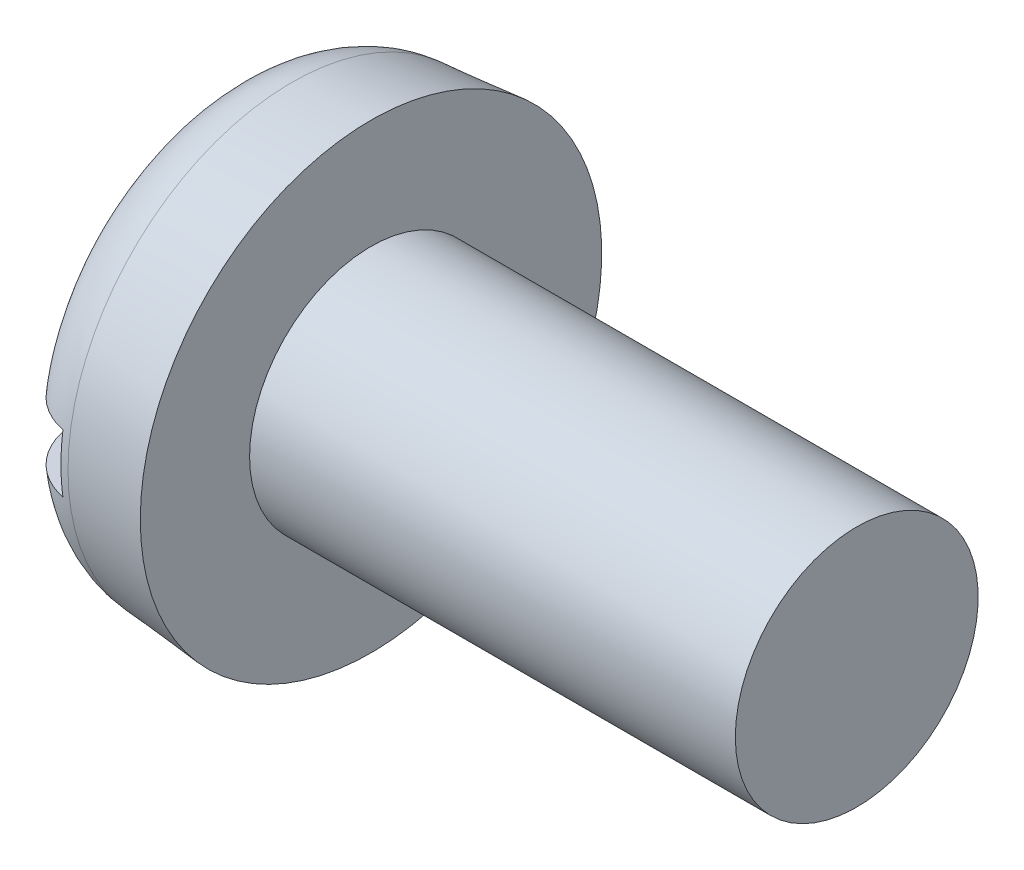
ISO-10303-21;
HEADER;
FILE_DESCRIPTION(('STEP AP214'),'2;1');
FILE_NAME('part.step','',(''),(''),'','','');
FILE_SCHEMA(('AUTOMOTIVE_DESIGN { 1 0 10303 214 1 1 1 1 }'));
ENDSEC;
DATA;
#1=APPLICATION_CONTEXT('core data for automotive mechanical design processes');
#2=APPLICATION_PROTOCOL_DEFINITION('international standard','automotive_design',2000,#1);
#3=PRODUCT_CONTEXT('',#1,'mechanical');
#4=PRODUCT('Part','Part','',(#3));
#5=PRODUCT_RELATED_PRODUCT_CATEGORY('part','',(#4));
#6=PRODUCT_DEFINITION_FORMATION('','',#4);
#7=PRODUCT_DEFINITION_CONTEXT('part definition',#1,'design');
#8=PRODUCT_DEFINITION('design','',#6,#7);
#9=PRODUCT_DEFINITION_SHAPE('','',#8);
#10=(LENGTH_UNIT() NAMED_UNIT(*) SI_UNIT(.MILLI.,.METRE.));
#11=(NAMED_UNIT(*) PLANE_ANGLE_UNIT() SI_UNIT($,.RADIAN.));
#12=(NAMED_UNIT(*) SI_UNIT($,.STERADIAN.) SOLID_ANGLE_UNIT());
#13=UNCERTAINTY_MEASURE_WITH_UNIT(LENGTH_MEASURE(1.E-05),#10,'distance_accuracy_value','');
#14=(GEOMETRIC_REPRESENTATION_CONTEXT(3) GLOBAL_UNCERTAINTY_ASSIGNED_CONTEXT((#13)) GLOBAL_UNIT_ASSIGNED_CONTEXT((#10,
#11,#12)) REPRESENTATION_CONTEXT('',''));
#15=CARTESIAN_POINT('',(0.,0.,0.));
#16=DIRECTION('',(0.,0.,1.));
#17=DIRECTION('',(1.,0.,0.));
#18=AXIS2_PLACEMENT_3D('',#15,#16,#17);
#19=CARTESIAN_POINT('',(0.,0.,0.));
#20=DIRECTION('',(-1.,0.,0.));
#21=DIRECTION('',(0.,0.,1.));
#22=AXIS2_PLACEMENT_3D('',#19,#20,#21);
#23=PLANE('',#22);
#24=DIRECTION('',(0.,0.,-1.));
#25=VECTOR('',#24,1.);
#26=CARTESIAN_POINT('',(0.,0.599999999999999,4.75));
#27=LINE('',#26,#25);
#28=CARTESIAN_POINT('',(0.,0.599999999999999,3.05466870706162));
#29=VERTEX_POINT('',#28);
#30=CARTESIAN_POINT('',(0.,0.599999999999999,-3.05466870706162));
#31=VERTEX_POINT('',#30);
#32=EDGE_CURVE('E85',#29,#31,#27,.T.);
#33=ORIENTED_EDGE('',*,*,#32,.F.);
#34=CARTESIAN_POINT('',(0.,0.,0.));
#35=DIRECTION('',(-1.,0.,0.));
#36=DIRECTION('',(0.,0.,1.));
#37=AXIS2_PLACEMENT_3D('',#34,#35,#36);
#38=CIRCLE('',#37,3.11303724839609);
#39=EDGE_CURVE('E91',#29,#31,#38,.T.);
#40=ORIENTED_EDGE('',*,*,#39,.T.);
#41=EDGE_LOOP('',(#33,#40));
#42=FACE_BOUND('',#41,.T.);
#43=ADVANCED_FACE('F32',(#42),#23,.T.);
#44=CARTESIAN_POINT('',(-25.4,0.,0.));
#45=DIRECTION('',(-1.,0.,0.));
#46=DIRECTION('',(0.,0.,1.));
#47=AXIS2_PLACEMENT_3D('',#44,#45,#46);
#48=CYLINDRICAL_SURFACE('',#47,2.5);
#49=CARTESIAN_POINT('',(13.,0.,0.));
#50=DIRECTION('',(-1.,0.,0.));
#51=DIRECTION('',(0.,0.,1.));
#52=AXIS2_PLACEMENT_3D('',#49,#50,#51);
#53=CIRCLE('',#52,2.5);
#54=CARTESIAN_POINT('',(13.,0.,2.5));
#55=VERTEX_POINT('',#54);
#56=EDGE_CURVE('E92',#55,#55,#53,.T.);
#57=ORIENTED_EDGE('',*,*,#56,.T.);
#58=EDGE_LOOP('',(#57));
#59=FACE_BOUND('',#58,.T.);
#60=CARTESIAN_POINT('',(3.,0.,0.));
#61=DIRECTION('',(-1.,0.,0.));
#62=DIRECTION('',(0.,0.,1.));
#63=AXIS2_PLACEMENT_3D('',#60,#61,#62);
#64=CIRCLE('',#63,2.5);
#65=CARTESIAN_POINT('',(3.,0.,2.5));
#66=VERTEX_POINT('',#65);
#67=EDGE_CURVE('E149',#66,#66,#64,.T.);
#68=ORIENTED_EDGE('',*,*,#67,.F.);
#69=EDGE_LOOP('',(#68));
#70=FACE_BOUND('',#69,.T.);
#71=ADVANCED_FACE('F137',(#59,#70),#48,.T.);
#72=CARTESIAN_POINT('',(13.,2.5,0.));
#73=DIRECTION('',(1.,0.,0.));
#74=DIRECTION('',(0.,0.,-1.));
#75=AXIS2_PLACEMENT_3D('',#72,#73,#74);
#76=PLANE('',#75);
#77=ORIENTED_EDGE('',*,*,#56,.F.);
#78=EDGE_LOOP('',(#77));
#79=FACE_BOUND('',#78,.T.);
#80=ADVANCED_FACE('F135',(#79),#76,.T.);
#81=DIRECTION('',(0.,0.,1.));
#82=VECTOR('',#81,1.);
#83=CARTESIAN_POINT('',(0.,-0.599999999999999,-4.75));
#84=LINE('',#83,#82);
#85=CARTESIAN_POINT('',(0.,-0.599999999999999,-3.05466870706162));
#86=VERTEX_POINT('',#85);
#87=CARTESIAN_POINT('',(0.,-0.6,3.05466870706162));
#88=VERTEX_POINT('',#87);
#89=EDGE_CURVE('E76',#86,#88,#84,.T.);
#90=ORIENTED_EDGE('',*,*,#89,.F.);
#91=EDGE_CURVE('E83',#86,#88,#38,.T.);
#92=ORIENTED_EDGE('',*,*,#91,.T.);
#93=EDGE_LOOP('',(#90,#92));
#94=FACE_BOUND('',#93,.T.);
#95=ADVANCED_FACE('F82',(#94),#23,.T.);
#96=CARTESIAN_POINT('',(0.,0.,0.));
#97=DIRECTION('',(1.,0.,0.));
#98=DIRECTION('',(0.,0.,-1.));
#99=AXIS2_PLACEMENT_3D('',#96,#97,#98);
#100=CONICAL_SURFACE('',#99,4.48753400942223,0.0872664625997167);
#101=CARTESIAN_POINT('',(1.36926638587852,0.,0.));
#102=DIRECTION('',(-1.,0.,0.));
#103=DIRECTION('',(0.,0.,1.));
#104=AXIS2_PLACEMENT_3D('',#101,#102,#103);
#105=CIRCLE('',#104,4.60732929553371);
#106=CARTESIAN_POINT('',(1.36926638587852,0.,4.60732929553371));
#107=VERTEX_POINT('',#106);
#108=EDGE_CURVE('E95',#107,#107,#105,.F.);
#109=ORIENTED_EDGE('',*,*,#108,.T.);
#110=EDGE_LOOP('',(#109));
#111=FACE_BOUND('',#110,.T.);
#112=CARTESIAN_POINT('',(3.,0.,0.));
#113=DIRECTION('',(-1.,0.,0.));
#114=DIRECTION('',(0.,0.,1.));
#115=AXIS2_PLACEMENT_3D('',#112,#113,#114);
#116=CIRCLE('',#115,4.75);
#117=CARTESIAN_POINT('',(3.,0.,4.75));
#118=VERTEX_POINT('',#117);
#119=EDGE_CURVE('E97',#118,#118,#116,.T.);
#120=ORIENTED_EDGE('',*,*,#119,.T.);
#121=EDGE_LOOP('',(#120));
#122=FACE_BOUND('',#121,.T.);
#123=ADVANCED_FACE('F128',(#111,#122),#100,.T.);
#124=CARTESIAN_POINT('',(3.,2.5,0.));
#125=DIRECTION('',(-1.,0.,0.));
#126=DIRECTION('',(0.,0.,1.));
#127=AXIS2_PLACEMENT_3D('',#124,#125,#126);
#128=PLANE('',#127);
#129=ORIENTED_EDGE('',*,*,#119,.F.);
#130=EDGE_LOOP('',(#129));
#131=FACE_BOUND('',#130,.T.);
#132=ORIENTED_EDGE('',*,*,#67,.T.);
#133=EDGE_LOOP('',(#132));
#134=FACE_BOUND('',#133,.T.);
#135=ADVANCED_FACE('F124',(#131,#134),#128,.F.);
#136=CARTESIAN_POINT('',(1.5,0.,0.));
#137=DIRECTION('',(-1.,0.,0.));
#138=DIRECTION('',(0.,0.,1.));
#139=AXIS2_PLACEMENT_3D('',#136,#137,#138);
#140=TOROIDAL_SURFACE('',#139,3.11303724839609,1.5);
#141=CARTESIAN_POINT('',(0.474243658414118,0.599999999999999,-4.16448807896819));
#142=CARTESIAN_POINT('',(0.535197295081718,0.599999999999999,-4.2222007669978));
#143=CARTESIAN_POINT('',(0.601040982035107,0.599999999999999,-4.27483380157402));
#144=CARTESIAN_POINT('',(0.740675618941929,0.599999999999999,-4.36835495475348));
#145=CARTESIAN_POINT('',(0.814475349823812,0.599999999999999,-4.40922990992468));
#146=CARTESIAN_POINT('',(0.967890518125633,0.599999999999999,-4.47797693612467));
#147=CARTESIAN_POINT('',(1.04750461127898,0.599999999999999,-4.50585200175864));
#148=CARTESIAN_POINT('',(1.21027286001061,0.599999999999999,-4.54777716021195));
#149=CARTESIAN_POINT('',(1.29342617347519,0.599999999999999,-4.56183052276117));
#150=CARTESIAN_POINT('',(1.46061786799049,0.599999999999999,-4.57568541247955));
#151=CARTESIAN_POINT('',(1.54465212521589,0.599999999999999,-4.57553672087045));
#152=CARTESIAN_POINT('',(1.71150157995688,0.599999999999999,-4.56111544224188));
#153=CARTESIAN_POINT('',(1.79431675124403,0.599999999999999,-4.546842551792));
#154=CARTESIAN_POINT('',(1.95628107406591,0.599999999999999,-4.50461633201918));
#155=CARTESIAN_POINT('',(2.03543426015628,0.599999999999999,-4.47667847075145));
#156=CARTESIAN_POINT('',(2.18794473500218,0.599999999999999,-4.40794662558744));
#157=CARTESIAN_POINT('',(2.26130200278936,0.599999999999999,-4.36715259518307));
#158=CARTESIAN_POINT('',(2.40037319828889,0.599999999999999,-4.27376142336048));
#159=CARTESIAN_POINT('',(2.46606492244737,0.599999999999999,-4.22113122683346));
#160=CARTESIAN_POINT('',(2.58775416704056,0.599999999999999,-4.10565865600867));
#161=CARTESIAN_POINT('',(2.64375146828425,0.599999999999999,-4.04281605087046));
#162=CARTESIAN_POINT('',(2.7448997840385,0.599999999999999,-3.90824759164118));
#163=CARTESIAN_POINT('',(2.78997229238531,0.599999999999999,-3.83646274539756));
#164=CARTESIAN_POINT('',(2.86758143470365,0.599999999999999,-3.6864129682638));
#165=CARTESIAN_POINT('',(2.90011748599835,0.599999999999999,-3.60814773637982));
#166=CARTESIAN_POINT('',(2.95215516169723,0.599999999999999,-3.44640006360479));
#167=CARTESIAN_POINT('',(2.9715017345089,0.599999999999999,-3.36286776428823));
#168=CARTESIAN_POINT('',(2.99613620168572,0.599999999999999,-3.19375865105955));
#169=CARTESIAN_POINT('',(3.00142305536604,0.599999999999999,-3.10818168627657));
#170=CARTESIAN_POINT('',(2.9978948813525,0.599999999999999,-2.93593785339293));
#171=CARTESIAN_POINT('',(2.98885075685912,0.599999999999999,-2.84927570052428));
#172=CARTESIAN_POINT('',(2.95661294496956,0.599999999999999,-2.67862588478662));
#173=CARTESIAN_POINT('',(2.93341783650053,0.599999999999999,-2.59463849141423));
#174=CARTESIAN_POINT('',(2.87305940877561,0.599999999999999,-2.43009011436867));
#175=CARTESIAN_POINT('',(2.8356478828304,0.599999999999999,-2.3496201371126));
#176=CARTESIAN_POINT('',(2.74798933787028,0.599999999999999,-2.1959917281391));
#177=CARTESIAN_POINT('',(2.69774036841306,0.599999999999999,-2.12283440981409));
#178=CARTESIAN_POINT('',(2.58515210313488,0.599999999999999,-1.98517825774364));
#179=CARTESIAN_POINT('',(2.52268993172068,0.599999999999999,-1.92077976119305));
#180=CARTESIAN_POINT('',(2.3876474493881,0.599999999999999,-1.80360821500934));
#181=CARTESIAN_POINT('',(2.31506700040253,0.599999999999999,-1.75083532403676));
#182=CARTESIAN_POINT('',(2.16324197079703,0.599999999999999,-1.65981326851198));
#183=CARTESIAN_POINT('',(2.08415844928075,0.599999999999999,-1.62129637029772));
#184=CARTESIAN_POINT('',(1.92036681915816,0.599999999999999,-1.55909823822307));
#185=CARTESIAN_POINT('',(1.83566227533763,0.599999999999999,-1.53540769925334));
#186=CARTESIAN_POINT('',(1.66868507009008,0.599999999999999,-1.50512561227213));
#187=CARTESIAN_POINT('',(1.58658829454821,0.599999999999999,-1.4975631393788));
#188=CARTESIAN_POINT('',(1.42235866322455,0.599999999999999,-1.49703912758717));
#189=CARTESIAN_POINT('',(1.34022582120447,0.599999999999999,-1.50407401302566));
#190=CARTESIAN_POINT('',(1.18200056282713,0.599999999999999,-1.53172166919514));
#191=CARTESIAN_POINT('',(1.10580089104436,0.599999999999999,-1.55172937668989));
#192=CARTESIAN_POINT('',(0.957649664563,0.599999999999999,-1.60381093076415));
#193=CARTESIAN_POINT('',(0.885698997531768,0.599999999999999,-1.63588728838267));
#194=CARTESIAN_POINT('',(0.745245700500113,0.599999999999999,-1.71223681434578));
#195=CARTESIAN_POINT('',(0.676958373668154,0.599999999999999,-1.75690511342937));
#196=CARTESIAN_POINT('',(0.548253189657998,0.599999999999999,-1.85641398037802));
#197=CARTESIAN_POINT('',(0.487837367378207,0.599999999999999,-1.91125716975333));
#198=CARTESIAN_POINT('',(0.372604632815819,0.599999999999999,-2.0333995748207));
#199=CARTESIAN_POINT('',(0.318393734552892,0.599999999999999,-2.10127142840843));
#200=CARTESIAN_POINT('',(0.22172170046403,0.599999999999999,-2.24492747086233));
#201=CARTESIAN_POINT('',(0.179262687674716,0.599999999999999,-2.32071308598748));
#202=CARTESIAN_POINT('',(0.106126434693669,0.599999999999999,-2.48060945032927));
#203=CARTESIAN_POINT('',(0.0758504579499817,0.599999999999999,-2.56490423799231));
#204=CARTESIAN_POINT('',(0.0299480528791069,0.599999999999999,-2.737393644571));
#205=CARTESIAN_POINT('',(0.0143211057149615,0.599999999999999,-2.82558812525209));
#206=CARTESIAN_POINT('',(-0.00166405076915353,0.599999999999999,-3.00295249376628));
#207=CARTESIAN_POINT('',(-0.0020913391866633,0.599999999999999,-3.09211612589326));
#208=CARTESIAN_POINT('',(0.012315323636572,0.599999999999999,-3.26923006707988));
#209=CARTESIAN_POINT('',(0.0271518634913197,0.599999999999999,-3.35718016777113));
#210=CARTESIAN_POINT('',(0.0713942440842871,0.599999999999999,-3.52770551832453));
#211=CARTESIAN_POINT('',(0.100543843103939,0.599999999999999,-3.61034739221481));
#212=CARTESIAN_POINT('',(0.172532615577993,0.599999999999999,-3.7693538221972));
#213=CARTESIAN_POINT('',(0.215353537348166,0.599999999999999,-3.84572657785127));
#214=CARTESIAN_POINT('',(0.294810584189995,0.599999999999999,-3.9625299446579));
#215=CARTESIAN_POINT('',(0.327631230412885,0.599999999999999,-4.00560511672895));
#216=CARTESIAN_POINT('',(0.397705420360597,0.599999999999999,-4.08798619296731));
#217=CARTESIAN_POINT('',(0.434958917942831,0.599999999999999,-4.12729213636171));
#218=CARTESIAN_POINT('',(0.474243658414118,0.599999999999999,-4.16448807896819));
#219=B_SPLINE_CURVE_WITH_KNOTS('',3,(#141,#142,#143,#144,#145,#146,#147,#148,#149,#150,#151,
#152,#153,#154,#155,#156,#157,#158,#159,#160,#161,#162,#163,#164,#165,#166,#167,#168,#169,#170,
#171,#172,#173,#174,#175,#176,#177,#178,#179,#180,#181,#182,#183,#184,#185,#186,#187,#188,#189,
#190,#191,#192,#193,#194,#195,#196,#197,#198,#199,#200,#201,#202,#203,#204,#205,#206,#207,#208,
#209,#210,#211,#212,#213,#214,#215,#216,#217,#218),.UNSPECIFIED.,.T.,.F.,(4,2,2,2,2,2,2,2,2,2,2,
2,2,2,2,2,2,2,2,2,2,2,2,2,2,2,2,2,2,2,2,2,2,2,2,2,2,2,4),(0.,0.251627146356527,
0.503534908230532,0.755384612891179,1.00717472440947,1.25808229051165,1.50899524698256,
1.75962483769725,2.01025533509253,2.26159466241291,2.5129396717769,2.76604060118133,
3.01915329294131,3.27519243939531,3.53125053705573,3.79144347935941,4.05166255511108,
4.31665070629994,4.58167914212856,4.84952563339749,5.1173757798769,5.37990411366445,
5.64226751747475,5.88833003654373,6.13433228903482,6.36961414082621,6.60494497315005,
6.84869102964653,7.09249997354317,7.35191672321244,7.61138030726588,7.87880123289685,
8.14621268669888,8.41240865838555,8.67864978206268,8.94028930530327,9.20158098124828,
9.36375686720108,9.52593106517475),.UNSPECIFIED.);
#220=CARTESIAN_POINT('',(1.2,0.599999999999999,-4.54328342507039));
#221=VERTEX_POINT('',#220);
#222=EDGE_CURVE('E11',#31,#221,#219,.T.);
#223=ORIENTED_EDGE('',*,*,#222,.F.);
#224=ORIENTED_EDGE('',*,*,#39,.F.);
#225=CARTESIAN_POINT('',(0.642058610680042,0.599999999999999,1.78444467937446));
#226=CARTESIAN_POINT('',(0.708203036380362,0.599999999999999,1.73578880648515));
#227=CARTESIAN_POINT('',(0.778279368670585,0.599999999999999,1.69241067896619));
#228=CARTESIAN_POINT('',(0.924661322194506,0.599999999999999,1.61775076908607));
#229=CARTESIAN_POINT('',(1.00097010153863,0.599999999999999,1.58647516596051));
#230=CARTESIAN_POINT('',(1.15801751585214,0.599999999999999,1.537335320697));
#231=CARTESIAN_POINT('',(1.23876602400661,0.599999999999999,1.51950238335516));
#232=CARTESIAN_POINT('',(1.40212199318037,0.599999999999999,1.49831173721129));
#233=CARTESIAN_POINT('',(1.48472861131334,0.599999999999999,1.49494759299464));
#234=CARTESIAN_POINT('',(1.64595983892255,0.599999999999999,1.50270631694742));
#235=CARTESIAN_POINT('',(1.72461257951398,0.599999999999999,1.51326068591234));
#236=CARTESIAN_POINT('',(1.8790539429005,0.599999999999999,1.54733501871428));
#237=CARTESIAN_POINT('',(1.95484205263035,0.599999999999999,1.57085729349997));
#238=CARTESIAN_POINT('',(2.10217401155429,0.599999999999999,1.63005609035764));
#239=CARTESIAN_POINT('',(2.17368023107982,0.599999999999999,1.6658257964978));
#240=CARTESIAN_POINT('',(2.310172961278,0.599999999999999,1.74815983417116));
#241=CARTESIAN_POINT('',(2.37515789157211,0.599999999999999,1.79472677331303));
#242=CARTESIAN_POINT('',(2.50111037711804,0.599999999999999,1.90052230428761));
#243=CARTESIAN_POINT('',(2.56156048338467,0.599999999999999,1.96036731204705));
#244=CARTESIAN_POINT('',(2.67210720393706,0.599999999999999,2.08896077435074));
#245=CARTESIAN_POINT('',(2.72220143615073,0.599999999999999,2.15771127144529));
#246=CARTESIAN_POINT('',(2.81284735135057,0.599999999999999,2.30563751942184));
#247=CARTESIAN_POINT('',(2.85285618308496,0.599999999999999,2.38514674405519));
#248=CARTESIAN_POINT('',(2.91905433916055,0.599999999999999,2.54972911303286));
#249=CARTESIAN_POINT('',(2.94524280154325,0.599999999999999,2.63480260404143));
#250=CARTESIAN_POINT('',(2.98307112118201,0.599999999999999,2.80866920463374));
#251=CARTESIAN_POINT('',(2.9946229028891,0.599999999999999,2.89748154042669));
#252=CARTESIAN_POINT('',(3.00240662044448,0.599999999999999,3.07577878271611));
#253=CARTESIAN_POINT('',(2.998639535268,0.599999999999999,3.16526364586891));
#254=CARTESIAN_POINT('',(2.97592433492495,0.599999999999999,3.34090743505534));
#255=CARTESIAN_POINT('',(2.95720740518343,0.599999999999999,3.42709622339191));
#256=CARTESIAN_POINT('',(2.90529569495245,0.599999999999999,3.59499998139678));
#257=CARTESIAN_POINT('',(2.87210231417948,0.599999999999999,3.67671538273376));
#258=CARTESIAN_POINT('',(2.7928517179968,0.599999999999999,3.83175947436551));
#259=CARTESIAN_POINT('',(2.7470416079032,0.599999999999999,3.90521449832402));
#260=CARTESIAN_POINT('',(2.64356788428019,0.599999999999999,4.04323981666841));
#261=CARTESIAN_POINT('',(2.58590525096435,0.599999999999999,4.10781084503144));
#262=CARTESIAN_POINT('',(2.46128327363286,0.599999999999999,4.22525214803112));
#263=CARTESIAN_POINT('',(2.39447165884279,0.599999999999999,4.27827922672086));
#264=CARTESIAN_POINT('',(2.25282231663691,0.599999999999999,4.37223374872955));
#265=CARTESIAN_POINT('',(2.17798504745557,0.599999999999999,4.41316188235174));
#266=CARTESIAN_POINT('',(2.02319107359916,0.599999999999999,4.48136089688119));
#267=CARTESIAN_POINT('',(1.94329070056969,0.599999999999999,4.50875968064268));
#268=CARTESIAN_POINT('',(1.78001182353897,0.599999999999999,4.54967680022656));
#269=CARTESIAN_POINT('',(1.69663343662667,0.599999999999999,4.5631956029331));
#270=CARTESIAN_POINT('',(1.52922201877973,0.599999999999999,4.57591948614666));
#271=CARTESIAN_POINT('',(1.44519451467758,0.599999999999999,4.57519739831531));
#272=CARTESIAN_POINT('',(1.27845728205918,0.599999999999999,4.55963992951435));
#273=CARTESIAN_POINT('',(1.19574753661822,0.599999999999999,4.54480472995607));
#274=CARTESIAN_POINT('',(1.0340786964162,0.599999999999999,4.50147996674511));
#275=CARTESIAN_POINT('',(0.95511580497124,0.599999999999999,4.47300456410203));
#276=CARTESIAN_POINT('',(0.803072557916503,0.599999999999999,4.40323812076547));
#277=CARTESIAN_POINT('',(0.729992230871329,0.599999999999999,4.36194701784613));
#278=CARTESIAN_POINT('',(0.59154832178526,0.599999999999999,4.26761123534465));
#279=CARTESIAN_POINT('',(0.526207791263906,0.599999999999999,4.21453273512057));
#280=CARTESIAN_POINT('',(0.405289615956489,0.599999999999999,4.09822911813057));
#281=CARTESIAN_POINT('',(0.349712219818471,0.599999999999999,4.03500374302192));
#282=CARTESIAN_POINT('',(0.249458610454665,0.599999999999999,3.89973755418921));
#283=CARTESIAN_POINT('',(0.204862261848366,0.599999999999999,3.82763756530843));
#284=CARTESIAN_POINT('',(0.128249666801426,0.599999999999999,3.67704118571855));
#285=CARTESIAN_POINT('',(0.0962340514322336,0.599999999999999,3.59854447437713));
#286=CARTESIAN_POINT('',(0.0452695618067232,0.599999999999999,3.43641182137041));
#287=CARTESIAN_POINT('',(0.0264776176058502,0.599999999999999,3.35272657587564));
#288=CARTESIAN_POINT('',(0.00296961847805913,0.599999999999999,3.18340853745579));
#289=CARTESIAN_POINT('',(-0.00174593998245755,0.599999999999999,3.09777567594668));
#290=CARTESIAN_POINT('',(0.00293340013673355,0.599999999999999,2.92551527624344));
#291=CARTESIAN_POINT('',(0.0125572207885083,0.599999999999999,2.83889398520231));
#292=CARTESIAN_POINT('',(0.045943488468087,0.599999999999999,2.66839997628858));
#293=CARTESIAN_POINT('',(0.0697105175713762,0.599999999999999,2.58452815847766));
#294=CARTESIAN_POINT('',(0.131206336652359,0.599999999999999,2.42028022462041));
#295=CARTESIAN_POINT('',(0.169188113823741,0.599999999999999,2.3399989156054));
#296=CARTESIAN_POINT('',(0.257932526861988,0.599999999999999,2.18690708694784));
#297=CARTESIAN_POINT('',(0.308683970707915,0.599999999999999,2.11409010341861));
#298=CARTESIAN_POINT('',(0.405756463268019,0.599999999999999,1.9970345012659));
#299=CARTESIAN_POINT('',(0.449343361783641,0.599999999999999,1.9505006311258));
#300=CARTESIAN_POINT('',(0.54185180488945,0.599999999999999,1.86306846860713));
#301=CARTESIAN_POINT('',(0.590773331141202,0.599999999999999,1.82217015685672));
#302=CARTESIAN_POINT('',(0.642058610680042,0.599999999999999,1.78444467937446));
#303=B_SPLINE_CURVE_WITH_KNOTS('',3,(#225,#226,#227,#228,#229,#230,#231,#232,#233,#234,#235,
#236,#237,#238,#239,#240,#241,#242,#243,#244,#245,#246,#247,#248,#249,#250,#251,#252,#253,#254,
#255,#256,#257,#258,#259,#260,#261,#262,#263,#264,#265,#266,#267,#268,#269,#270,#271,#272,#273,
#274,#275,#276,#277,#278,#279,#280,#281,#282,#283,#284,#285,#286,#287,#288,#289,#290,#291,#292,
#293,#294,#295,#296,#297,#298,#299,#300,#301,#302),.UNSPECIFIED.,.T.,.F.,(4,2,2,2,2,2,2,2,2,2,2,
2,2,2,2,2,2,2,2,2,2,2,2,2,2,2,2,2,2,2,2,2,2,2,2,2,2,2,4),(0.,0.24612605094912,0.492377602199398,
0.739200858505262,0.985914321661776,1.22285638708156,1.45984069047221,1.69866969249371,
1.93755643360865,2.19161852079116,2.4457389828121,2.7115111582947,2.97729990768455,
3.24468054855035,3.51204410232254,3.77535136144166,4.03863316723461,4.29708605172546,
4.55551757054057,4.81018291238315,5.06483372153258,5.31702870002424,5.56921519509694,
5.82011227807357,6.07100613603813,6.32164008325893,6.57227524743668,6.8236390500764,
7.07500925353546,7.32815697181226,7.58131738679819,7.83743366852287,8.09355898322155,
8.35381727867223,8.61415993778767,8.87937525371496,9.14435892551919,9.33519415587659,
9.52602873023522),.UNSPECIFIED.);
#304=CARTESIAN_POINT('',(1.2,0.599999999999999,4.54328342507039));
#305=VERTEX_POINT('',#304);
#306=EDGE_CURVE('E109',#305,#29,#303,.T.);
#307=ORIENTED_EDGE('',*,*,#306,.F.);
#308=CARTESIAN_POINT('',(1.2,0.,0.));
#309=DIRECTION('',(-1.,0.,0.));
#310=DIRECTION('',(0.,0.,1.));
#311=AXIS2_PLACEMENT_3D('',#308,#309,#310);
#312=CIRCLE('',#311,4.582731094066);
#313=CARTESIAN_POINT('',(1.2,-0.6,4.54328342507039));
#314=VERTEX_POINT('',#313);
#315=EDGE_CURVE('E103',#305,#314,#312,.F.);
#316=ORIENTED_EDGE('',*,*,#315,.T.);
#317=CARTESIAN_POINT('',(0.642058610680042,-0.6,1.78444467937446));
#318=CARTESIAN_POINT('',(0.570752920194344,-0.6,1.83690352165546));
#319=CARTESIAN_POINT('',(0.503916077557702,-0.6,1.89557553746954));
#320=CARTESIAN_POINT('',(0.380973771249588,-0.6,2.02337981777742));
#321=CARTESIAN_POINT('',(0.324888104535172,-0.6,2.09253096708466));
#322=CARTESIAN_POINT('',(0.225075106987112,-0.6,2.23912059870425));
#323=CARTESIAN_POINT('',(0.181331918593532,-0.6,2.31654826929466));
#324=CARTESIAN_POINT('',(0.10735821367674,-0.6,2.4775679899402));
#325=CARTESIAN_POINT('',(0.0771217912441208,-0.6,2.56115732710836));
#326=CARTESIAN_POINT('',(0.0308710334301756,-0.6,2.732939000609));
#327=CARTESIAN_POINT('',(0.0149771235015866,-0.6,2.82116384865448));
#328=CARTESIAN_POINT('',(-0.0015567085978271,-0.6,2.99904386168456));
#329=CARTESIAN_POINT('',(-0.00219606146843858,-0.6,3.08869907992565));
#330=CARTESIAN_POINT('',(0.0118531750273403,-0.6,3.26558059450901));
#331=CARTESIAN_POINT('',(0.0263341086851242,-0.6,3.35282334181458));
#332=CARTESIAN_POINT('',(0.0700194219118658,-0.6,3.52354291562373));
#333=CARTESIAN_POINT('',(0.099222240134681,-0.6,3.60702014046144));
#334=CARTESIAN_POINT('',(0.170926065486002,-0.6,3.76619303294443));
#335=CARTESIAN_POINT('',(0.213170729681627,-0.6,3.84200419755192));
#336=CARTESIAN_POINT('',(0.309975915200245,-0.6,3.98530836166518));
#337=CARTESIAN_POINT('',(0.364535361492535,-0.6,4.05280208645523));
#338=CARTESIAN_POINT('',(0.483508684475232,-0.6,4.1764763252131));
#339=CARTESIAN_POINT('',(0.5477595028538,-0.6,4.23281374125409));
#340=CARTESIAN_POINT('',(0.684891583841532,-0.6,4.33376627620733));
#341=CARTESIAN_POINT('',(0.757772333681962,-0.6,4.37838209108102));
#342=CARTESIAN_POINT('',(0.909277514375007,-0.6,4.45415785006811));
#343=CARTESIAN_POINT('',(0.98783477360787,-0.6,4.4854521402466));
#344=CARTESIAN_POINT('',(1.14910626429923,-0.6,4.53432193971243));
#345=CARTESIAN_POINT('',(1.23182034060062,-0.6,4.55189796064285));
#346=CARTESIAN_POINT('',(1.39854874998173,-0.6,4.57274942770647));
#347=CARTESIAN_POINT('',(1.48255291835102,-0.6,4.57610622962971));
#348=CARTESIAN_POINT('',(1.64992840993139,-0.6,4.56864397492192));
#349=CARTESIAN_POINT('',(1.73329974306493,-0.6,4.55782514101937));
#350=CARTESIAN_POINT('',(1.89690556449748,-0.6,4.5223590940418));
#351=CARTESIAN_POINT('',(1.97714487002148,-0.6,4.49773409060875));
#352=CARTESIAN_POINT('',(2.13236381295566,-0.6,4.43539277076351));
#353=CARTESIAN_POINT('',(2.20734343564759,-0.6,4.39767641771933));
#354=CARTESIAN_POINT('',(2.35011399934713,-0.6,4.31014761840251));
#355=CARTESIAN_POINT('',(2.41788774226911,-0.6,4.26030712752721));
#356=CARTESIAN_POINT('',(2.54417141752924,-0.6,4.15002218012277));
#357=CARTESIAN_POINT('',(2.60268114659784,-0.6,4.08957749097928));
#358=CARTESIAN_POINT('',(2.70919785736716,-0.6,3.9593981011786));
#359=CARTESIAN_POINT('',(2.75713464541931,-0.6,3.88960598191475));
#360=CARTESIAN_POINT('',(2.84075534113332,-0.6,3.74303514835078));
#361=CARTESIAN_POINT('',(2.8764387276489,-0.6,3.66625613706859));
#362=CARTESIAN_POINT('',(2.93498131166689,-0.6,3.50699921856928));
#363=CARTESIAN_POINT('',(2.95769541532861,-0.6,3.42446799921996));
#364=CARTESIAN_POINT('',(2.98917609822224,-0.6,3.25679047887172));
#365=CARTESIAN_POINT('',(2.99794169095837,-0.6,3.17164399334453));
#366=CARTESIAN_POINT('',(3.00144063701761,-0.6,2.99973325818737));
#367=CARTESIAN_POINT('',(2.99595250839392,-0.6,2.91296452514108));
#368=CARTESIAN_POINT('',(2.97076041992884,-0.6,2.74151789560285));
#369=CARTESIAN_POINT('',(2.95105508300392,-0.6,2.6568402024715));
#370=CARTESIAN_POINT('',(2.8975856214985,-0.6,2.49032583794251));
#371=CARTESIAN_POINT('',(2.86356984972583,-0.6,2.40856994768616));
#372=CARTESIAN_POINT('',(2.78246737799466,-0.6,2.25181146670367));
#373=CARTESIAN_POINT('',(2.73537879887862,-0.6,2.17680984892826));
#374=CARTESIAN_POINT('',(2.6287380896727,-0.6,2.03476656024055));
#375=CARTESIAN_POINT('',(2.56903700220776,-0.6,1.96783656154918));
#376=CARTESIAN_POINT('',(2.43909597408642,-0.6,1.84509773172966));
#377=CARTESIAN_POINT('',(2.36885525311642,-0.6,1.7892897247435));
#378=CARTESIAN_POINT('',(2.22077231338664,-0.6,1.6915159991352));
#379=CARTESIAN_POINT('',(2.14305625383622,-0.6,1.64935982004576));
#380=CARTESIAN_POINT('',(1.98134627145675,-0.6,1.57962775362586));
#381=CARTESIAN_POINT('',(1.89735630501684,-0.6,1.55204276468685));
#382=CARTESIAN_POINT('',(1.73074700041176,-0.6,1.51405337057654));
#383=CARTESIAN_POINT('',(1.64833577109729,-0.6,1.50273689333596));
#384=CARTESIAN_POINT('',(1.48280159288123,-0.6,1.49493998663404));
#385=CARTESIAN_POINT('',(1.39967868925479,-0.6,1.49845862029257));
#386=CARTESIAN_POINT('',(1.23954957067745,-0.6,1.5195684163249));
#387=CARTESIAN_POINT('',(1.16244637491539,-0.6,1.53644040038296));
#388=CARTESIAN_POINT('',(1.01210690834996,-0.6,1.58254863585773));
#389=CARTESIAN_POINT('',(0.938866667961946,-0.6,1.61177190520217));
#390=CARTESIAN_POINT('',(0.828774784524273,-0.6,1.66615585264861));
#391=CARTESIAN_POINT('',(0.789995996461255,-0.6,1.68752043641598));
#392=CARTESIAN_POINT('',(0.714458930778061,-0.6,1.73355428555072));
#393=CARTESIAN_POINT('',(0.677700507765002,-0.6,1.75822331267792));
#394=CARTESIAN_POINT('',(0.642058610680042,-0.6,1.78444467937446));
#395=B_SPLINE_CURVE_WITH_KNOTS('',3,(#317,#318,#319,#320,#321,#322,#323,#324,#325,#326,#327,
#328,#329,#330,#331,#332,#333,#334,#335,#336,#337,#338,#339,#340,#341,#342,#343,#344,#345,#346,
#347,#348,#349,#350,#351,#352,#353,#354,#355,#356,#357,#358,#359,#360,#361,#362,#363,#364,#365,
#366,#367,#368,#369,#370,#371,#372,#373,#374,#375,#376,#377,#378,#379,#380,#381,#382,#383,#384,
#385,#386,#387,#388,#389,#390,#391,#392,#393,#394),.UNSPECIFIED.,.T.,.F.,(4,2,2,2,2,2,2,2,2,2,2,
2,2,2,2,2,2,2,2,2,2,2,2,2,2,2,2,2,2,2,2,2,2,2,2,2,2,2,4),(0.,0.265404287408956,
0.531292685713719,0.796837899918942,1.0622668890573,1.32990433121703,1.59755176159299,
1.86157117991747,2.12556260325236,2.38466409420983,2.64374297539626,2.89886888464049,
3.15397964254681,3.40645291166625,3.65891676397259,3.90993416729416,4.16094762666201,
4.41155844076078,4.66216995612038,4.91336677263593,5.1645691001095,5.41739205695792,
5.67022576522306,5.92583525765866,6.18146282704056,6.44108615261697,6.70073462877187,
6.96515356719701,7.22961053435908,7.49738541394544,7.76518012833671,8.0290593580903,
8.2927735653586,8.54103382495167,8.78927840642667,9.02499451309348,9.2604634792224,
9.39313443321414,9.5257958271829),.UNSPECIFIED.);
#396=EDGE_CURVE('E90',#88,#314,#395,.T.);
#397=ORIENTED_EDGE('',*,*,#396,.F.);
#398=ORIENTED_EDGE('',*,*,#91,.F.);
#399=CARTESIAN_POINT('',(0.474243658414118,-0.599999999999999,-4.16448807896819));
#400=CARTESIAN_POINT('',(0.412409598880791,-0.599999999999999,-4.10593108279507));
#401=CARTESIAN_POINT('',(0.35551684385051,-0.599999999999999,-4.04205754724208));
#402=CARTESIAN_POINT('',(0.253261315289024,-0.599999999999999,-3.90557965510244));
#403=CARTESIAN_POINT('',(0.207914149114803,-0.599999999999999,-3.83296367359279));
#404=CARTESIAN_POINT('',(0.130063655146865,-0.599999999999999,-3.68123851820338));
#405=CARTESIAN_POINT('',(0.0975468908299392,-0.599999999999999,-3.6021362424892));
#406=CARTESIAN_POINT('',(0.0461131584919345,-0.599999999999999,-3.43965944163403));
#407=CARTESIAN_POINT('',(0.027192755077115,-0.599999999999999,-3.35628600139622));
#408=CARTESIAN_POINT('',(0.00320871183677454,-0.599999999999999,-3.18666752505172));
#409=CARTESIAN_POINT('',(-0.00170544058983857,-0.599999999999999,-3.10040138080999));
#410=CARTESIAN_POINT('',(0.00275015450386982,-0.599999999999999,-2.92823768255229));
#411=CARTESIAN_POINT('',(0.012121771224685,-0.599999999999999,-2.84234017824524));
#412=CARTESIAN_POINT('',(0.0450616941974355,-0.599999999999999,-2.67171740352093));
#413=CARTESIAN_POINT('',(0.0688809362404413,-0.6,-2.58704058269751));
#414=CARTESIAN_POINT('',(0.130163556113852,-0.6,-2.42277478145277));
#415=CARTESIAN_POINT('',(0.16762851736669,-0.6,-2.34318639274353));
#416=CARTESIAN_POINT('',(0.255857344057143,-0.6,-2.19000637571054));
#417=CARTESIAN_POINT('',(0.306828885770341,-0.6,-2.11653425143792));
#418=CARTESIAN_POINT('',(0.420399039872087,-0.6,-1.97917572471576));
#419=CARTESIAN_POINT('',(0.482999461634803,-0.6,-1.91529081677178));
#420=CARTESIAN_POINT('',(0.618096870939253,-0.6,-1.79922493025403));
#421=CARTESIAN_POINT('',(0.69057820956695,-0.6,-1.74702578298915));
#422=CARTESIAN_POINT('',(0.843593951183152,-0.6,-1.65617143527356));
#423=CARTESIAN_POINT('',(0.924125644804995,-0.6,-1.61751169769628));
#424=CARTESIAN_POINT('',(1.08726160761867,-0.6,-1.5568894885869));
#425=CARTESIAN_POINT('',(1.16962117740598,-0.6,-1.53427068182255));
#426=CARTESIAN_POINT('',(1.33705452878567,-0.6,-1.50426955244288));
#427=CARTESIAN_POINT('',(1.42212670456288,-0.6,-1.49687837934546));
#428=CARTESIAN_POINT('',(1.58668515582688,-0.6,-1.4977182220952));
#429=CARTESIAN_POINT('',(1.66617813457182,-0.6,-1.50497326661195));
#430=CARTESIAN_POINT('',(1.82279518139799,-0.6,-1.53279061674343));
#431=CARTESIAN_POINT('',(1.89991905525904,-0.6,-1.55335401034864));
#432=CARTESIAN_POINT('',(2.04948924455596,-0.6,-1.6067410371576));
#433=CARTESIAN_POINT('',(2.1219498918965,-0.6,-1.63952477216219));
#434=CARTESIAN_POINT('',(2.26079027718803,-0.6,-1.71610282308371));
#435=CARTESIAN_POINT('',(2.32716854509061,-0.6,-1.75989979125895));
#436=CARTESIAN_POINT('',(2.45624783994444,-0.6,-1.86010993940373));
#437=CARTESIAN_POINT('',(2.51847841174256,-0.6,-1.91712921428644));
#438=CARTESIAN_POINT('',(2.6330655651466,-0.6,-2.04035161091106));
#439=CARTESIAN_POINT('',(2.68541975022597,-0.6,-2.10655695492612));
#440=CARTESIAN_POINT('',(2.78137899696925,-0.6,-2.24995520050261));
#441=CARTESIAN_POINT('',(2.82440841496879,-0.6,-2.32753422440308));
#442=CARTESIAN_POINT('',(2.89698988267455,-0.6,-2.48876491398966));
#443=CARTESIAN_POINT('',(2.92654080724739,-0.599999999999999,-2.57241708596369));
#444=CARTESIAN_POINT('',(2.97147838825361,-0.599999999999999,-2.74436421537141));
#445=CARTESIAN_POINT('',(2.98671795032272,-0.599999999999999,-2.83269773535865));
#446=CARTESIAN_POINT('',(3.0019280284079,-0.599999999999999,-3.01067371787383));
#447=CARTESIAN_POINT('',(3.00189936336754,-0.599999999999999,-3.10031610993974));
#448=CARTESIAN_POINT('',(2.98653324180044,-0.599999999999999,-3.27703669654448));
#449=CARTESIAN_POINT('',(2.97140689711054,-0.599999999999999,-3.36413320459129));
#450=CARTESIAN_POINT('',(2.92646546966695,-0.599999999999999,-3.53445278172725));
#451=CARTESIAN_POINT('',(2.89665181636002,-0.599999999999999,-3.6176762269009));
#452=CARTESIAN_POINT('',(2.82379055010926,-0.599999999999999,-3.77624709995532));
#453=CARTESIAN_POINT('',(2.78099811374452,-0.599999999999999,-3.85171179930222));
#454=CARTESIAN_POINT('',(2.68316564815073,-0.599999999999999,-3.99423591416513));
#455=CARTESIAN_POINT('',(2.62812664209884,-0.599999999999999,-4.06129603113645));
#456=CARTESIAN_POINT('',(2.50827792776917,-0.599999999999999,-4.18404243853999));
#457=CARTESIAN_POINT('',(2.44362896416776,-0.599999999999999,-4.23988572074516));
#458=CARTESIAN_POINT('',(2.3057910406187,-0.599999999999999,-4.33979100378519));
#459=CARTESIAN_POINT('',(2.23260257730431,-0.599999999999999,-4.38385368925633));
#460=CARTESIAN_POINT('',(2.08057460461136,-0.599999999999999,-4.45849174090687));
#461=CARTESIAN_POINT('',(2.00180044410622,-0.599999999999999,-4.4892002584956));
#462=CARTESIAN_POINT('',(1.84020059862298,-0.599999999999999,-4.53687031793267));
#463=CARTESIAN_POINT('',(1.75737522769582,-0.599999999999999,-4.55383292358267));
#464=CARTESIAN_POINT('',(1.59053176600544,-0.599999999999999,-4.5734537419064));
#465=CARTESIAN_POINT('',(1.50652325932082,-0.599999999999999,-4.57619356194969));
#466=CARTESIAN_POINT('',(1.33921886179209,-0.599999999999999,-4.56750581356187));
#467=CARTESIAN_POINT('',(1.25592315010696,-0.599999999999999,-4.55607478287623));
#468=CARTESIAN_POINT('',(1.09252935973304,-0.599999999999999,-4.51940184954632));
#469=CARTESIAN_POINT('',(1.01242810333302,-0.599999999999999,-4.49417405861641));
#470=CARTESIAN_POINT('',(0.857658852327387,-0.599999999999999,-4.4306700755768));
#471=CARTESIAN_POINT('',(0.782984185200619,-0.599999999999999,-4.39241024867637));
#472=CARTESIAN_POINT('',(0.669478794260354,-0.599999999999999,-4.32168602004624));
#473=CARTESIAN_POINT('',(0.628240695316524,-0.599999999999999,-4.29300657356294));
#474=CARTESIAN_POINT('',(0.548844190366555,-0.599999999999999,-4.23166298012919));
#475=CARTESIAN_POINT('',(0.510685774262919,-0.599999999999999,-4.1989988462444));
#476=CARTESIAN_POINT('',(0.474243658414118,-0.599999999999999,-4.16448807896819));
#477=B_SPLINE_CURVE_WITH_KNOTS('',3,(#399,#400,#401,#402,#403,#404,#405,#406,#407,#408,#409,
#410,#411,#412,#413,#414,#415,#416,#417,#418,#419,#420,#421,#422,#423,#424,#425,#426,#427,#428,
#429,#430,#431,#432,#433,#434,#435,#436,#437,#438,#439,#440,#441,#442,#443,#444,#445,#446,#447,
#448,#449,#450,#451,#452,#453,#454,#455,#456,#457,#458,#459,#460,#461,#462,#463,#464,#465,#466,
#467,#468,#469,#470,#471,#472,#473,#474,#475,#476),.UNSPECIFIED.,.T.,.F.,(4,2,2,2,2,2,2,2,2,2,2,
2,2,2,2,2,2,2,2,2,2,2,2,2,2,2,2,2,2,2,2,2,2,2,2,2,2,2,4),(0.,0.25529644851216,0.510936196701175,
0.766307513365804,1.02161428262746,1.27963589488398,1.53769127049753,1.80036244547743,
2.06306411001968,2.330066482792,2.5971104341561,2.86373626418763,3.13027266083284,
3.38515155325074,3.63988226518084,3.87819866101217,4.11653454226039,4.35409900070671,
4.59172072542034,4.84382021415258,5.09598079690533,5.36088081810939,5.62580294811466,
5.89341910899182,6.16102091571288,6.42493252583557,6.6888184557537,6.94781983448282,
7.20679958226834,7.46185384324978,7.71689327838005,7.96932796755385,8.22174311883919,
8.47270835111397,8.72373491187237,8.97450519451007,9.22496172187036,9.37542205599648,
9.52588189678136),.UNSPECIFIED.);
#478=CARTESIAN_POINT('',(1.2,-0.599999999999999,-4.54328342507039));
#479=VERTEX_POINT('',#478);
#480=EDGE_CURVE('E44',#479,#86,#477,.T.);
#481=ORIENTED_EDGE('',*,*,#480,.F.);
#482=EDGE_CURVE('E56',#479,#221,#312,.F.);
#483=ORIENTED_EDGE('',*,*,#482,.T.);
#484=EDGE_LOOP('',(#223,#224,#307,#316,#397,#398,#481,#483));
#485=FACE_BOUND('',#484,.T.);
#486=ORIENTED_EDGE('',*,*,#108,.F.);
#487=EDGE_LOOP('',(#486));
#488=FACE_BOUND('',#487,.T.);
#489=ADVANCED_FACE('F34',(#485,#488),#140,.T.);
#490=CARTESIAN_POINT('',(1.2,0.599999999999999,4.75));
#491=DIRECTION('',(0.,1.,0.));
#492=DIRECTION('',(0.,0.,1.));
#493=AXIS2_PLACEMENT_3D('',#490,#491,#492);
#494=PLANE('',#493);
#495=ORIENTED_EDGE('',*,*,#222,.T.);
#496=DIRECTION('',(0.,0.,-1.));
#497=VECTOR('',#496,1.);
#498=CARTESIAN_POINT('',(1.2,0.599999999999999,4.75));
#499=LINE('',#498,#497);
#500=EDGE_CURVE('E84',#305,#221,#499,.T.);
#501=ORIENTED_EDGE('',*,*,#500,.F.);
#502=ORIENTED_EDGE('',*,*,#306,.T.);
#503=ORIENTED_EDGE('',*,*,#32,.T.);
#504=EDGE_LOOP('',(#495,#501,#502,#503));
#505=FACE_BOUND('',#504,.T.);
#506=ADVANCED_FACE('F116',(#505),#494,.F.);
#507=CARTESIAN_POINT('',(1.2,-0.599999999999999,-4.75));
#508=DIRECTION('',(0.,-1.,0.));
#509=DIRECTION('',(0.,0.,-1.));
#510=AXIS2_PLACEMENT_3D('',#507,#508,#509);
#511=PLANE('',#510);
#512=ORIENTED_EDGE('',*,*,#480,.T.);
#513=ORIENTED_EDGE('',*,*,#89,.T.);
#514=ORIENTED_EDGE('',*,*,#396,.T.);
#515=DIRECTION('',(0.,0.,1.));
#516=VECTOR('',#515,1.);
#517=CARTESIAN_POINT('',(1.2,-0.599999999999999,-4.75));
#518=LINE('',#517,#516);
#519=EDGE_CURVE('E51',#479,#314,#518,.T.);
#520=ORIENTED_EDGE('',*,*,#519,.F.);
#521=EDGE_LOOP('',(#512,#513,#514,#520));
#522=FACE_BOUND('',#521,.T.);
#523=ADVANCED_FACE('F75',(#522),#511,.F.);
#524=CARTESIAN_POINT('',(1.2,0.599999999999999,-4.75));
#525=DIRECTION('',(-1.,0.,0.));
#526=DIRECTION('',(0.,0.,1.));
#527=AXIS2_PLACEMENT_3D('',#524,#525,#526);
#528=PLANE('',#527);
#529=ORIENTED_EDGE('',*,*,#519,.T.);
#530=ORIENTED_EDGE('',*,*,#315,.F.);
#531=ORIENTED_EDGE('',*,*,#500,.T.);
#532=ORIENTED_EDGE('',*,*,#482,.F.);
#533=EDGE_LOOP('',(#529,#530,#531,#532));
#534=FACE_BOUND('',#533,.T.);
#535=ADVANCED_FACE('F115',(#534),#528,.T.);
#536=CLOSED_SHELL('',(#43,#71,#80,#95,#123,#135,#489,#506,#523,#535));
#537=MANIFOLD_SOLID_BREP('B2',#536);
#538=ADVANCED_BREP_SHAPE_REPRESENTATION('',(#18,#537),#14);
#539=SHAPE_DEFINITION_REPRESENTATION(#9,#538);
ENDSEC;
END-ISO-10303-21;
